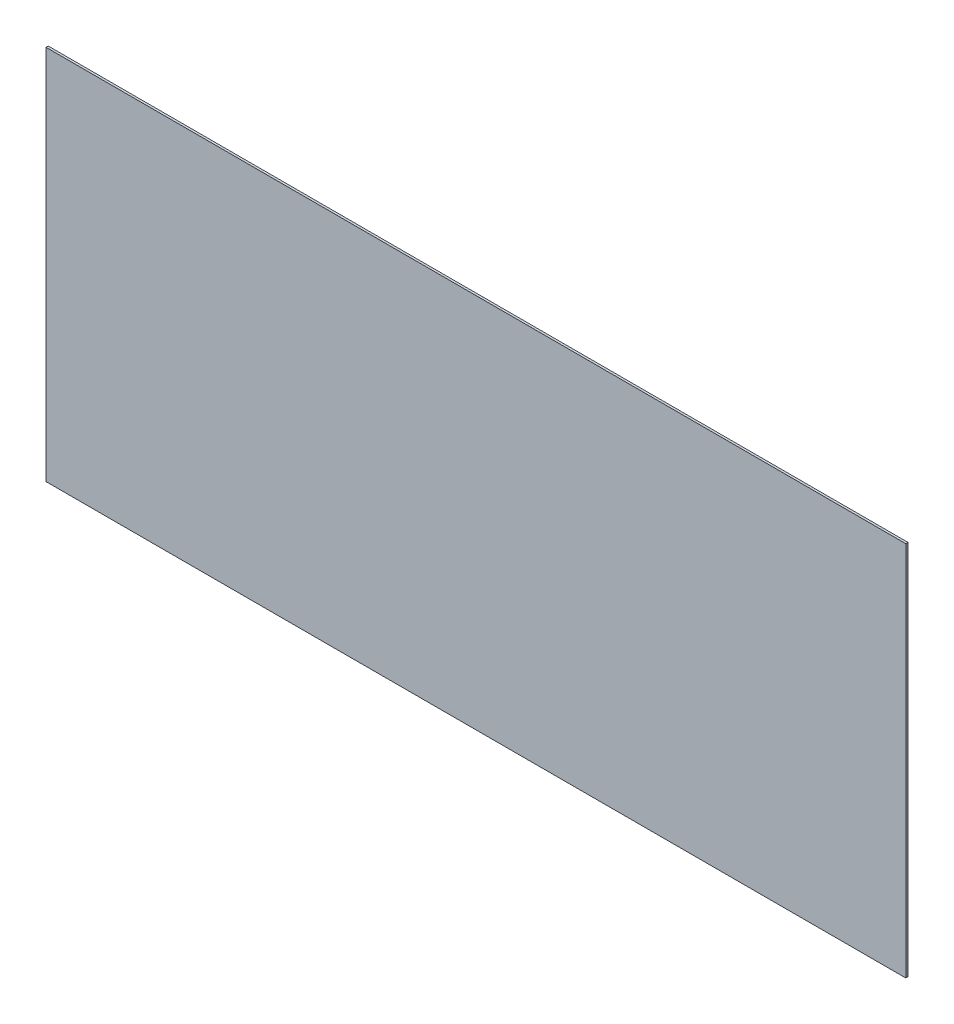
ISO-10303-21;
HEADER;
FILE_DESCRIPTION(('STEP AP214'),'2;1');
FILE_NAME('part.step','',(''),(''),'','','');
FILE_SCHEMA(('AUTOMOTIVE_DESIGN { 1 0 10303 214 1 1 1 1 }'));
ENDSEC;
DATA;
#1=APPLICATION_CONTEXT('core data for automotive mechanical design processes');
#2=APPLICATION_PROTOCOL_DEFINITION('international standard','automotive_design',2000,#1);
#3=PRODUCT_CONTEXT('',#1,'mechanical');
#4=PRODUCT('Part','Part','',(#3));
#5=PRODUCT_RELATED_PRODUCT_CATEGORY('part','',(#4));
#6=PRODUCT_DEFINITION_FORMATION('','',#4);
#7=PRODUCT_DEFINITION_CONTEXT('part definition',#1,'design');
#8=PRODUCT_DEFINITION('design','',#6,#7);
#9=PRODUCT_DEFINITION_SHAPE('','',#8);
#10=(LENGTH_UNIT() NAMED_UNIT(*) SI_UNIT(.MILLI.,.METRE.));
#11=(NAMED_UNIT(*) PLANE_ANGLE_UNIT() SI_UNIT($,.RADIAN.));
#12=(NAMED_UNIT(*) SI_UNIT($,.STERADIAN.) SOLID_ANGLE_UNIT());
#13=UNCERTAINTY_MEASURE_WITH_UNIT(LENGTH_MEASURE(1.E-05),#10,'distance_accuracy_value','');
#14=(GEOMETRIC_REPRESENTATION_CONTEXT(3) GLOBAL_UNCERTAINTY_ASSIGNED_CONTEXT((#13)) GLOBAL_UNIT_ASSIGNED_CONTEXT((#10,
#11,#12)) REPRESENTATION_CONTEXT('',''));
#15=CARTESIAN_POINT('',(0.,0.,0.));
#16=DIRECTION('',(0.,0.,1.));
#17=DIRECTION('',(1.,0.,0.));
#18=AXIS2_PLACEMENT_3D('',#15,#16,#17);
#19=CARTESIAN_POINT('',(0.,0.,3.175));
#20=DIRECTION('',(1.,0.,0.));
#21=DIRECTION('',(0.,0.,-1.));
#22=AXIS2_PLACEMENT_3D('',#19,#20,#21);
#23=PLANE('',#22);
#24=DIRECTION('',(0.,-1.,0.));
#25=VECTOR('',#24,1.);
#26=CARTESIAN_POINT('',(0.,0.,0.));
#27=LINE('',#26,#25);
#28=CARTESIAN_POINT('',(0.,533.4,0.));
#29=VERTEX_POINT('',#28);
#30=CARTESIAN_POINT('',(0.,0.,0.));
#31=VERTEX_POINT('',#30);
#32=EDGE_CURVE('E95',#29,#31,#27,.T.);
#33=ORIENTED_EDGE('',*,*,#32,.T.);
#34=DIRECTION('',(0.,0.,-1.));
#35=VECTOR('',#34,1.);
#36=CARTESIAN_POINT('',(0.,0.,3.175));
#37=LINE('',#36,#35);
#38=CARTESIAN_POINT('',(0.,0.,3.175));
#39=VERTEX_POINT('',#38);
#40=EDGE_CURVE('E11',#39,#31,#37,.T.);
#41=ORIENTED_EDGE('',*,*,#40,.F.);
#42=DIRECTION('',(0.,-1.,0.));
#43=VECTOR('',#42,1.);
#44=CARTESIAN_POINT('',(0.,0.,3.175));
#45=LINE('',#44,#43);
#46=CARTESIAN_POINT('',(0.,533.4,3.175));
#47=VERTEX_POINT('',#46);
#48=EDGE_CURVE('E83',#47,#39,#45,.T.);
#49=ORIENTED_EDGE('',*,*,#48,.F.);
#50=DIRECTION('',(0.,0.,-1.));
#51=VECTOR('',#50,1.);
#52=CARTESIAN_POINT('',(0.,533.4,3.175));
#53=LINE('',#52,#51);
#54=EDGE_CURVE('E91',#47,#29,#53,.T.);
#55=ORIENTED_EDGE('',*,*,#54,.T.);
#56=EDGE_LOOP('',(#33,#41,#49,#55));
#57=FACE_BOUND('',#56,.T.);
#58=ADVANCED_FACE('F32',(#57),#23,.F.);
#59=CARTESIAN_POINT('',(0.,0.,3.175));
#60=DIRECTION('',(0.,1.,0.));
#61=DIRECTION('',(0.,0.,1.));
#62=AXIS2_PLACEMENT_3D('',#59,#60,#61);
#63=PLANE('',#62);
#64=DIRECTION('',(1.,0.,0.));
#65=VECTOR('',#64,1.);
#66=CARTESIAN_POINT('',(0.,0.,0.));
#67=LINE('',#66,#65);
#68=CARTESIAN_POINT('',(1219.2,0.,0.));
#69=VERTEX_POINT('',#68);
#70=EDGE_CURVE('E87',#31,#69,#67,.T.);
#71=ORIENTED_EDGE('',*,*,#70,.T.);
#72=DIRECTION('',(0.,0.,-1.));
#73=VECTOR('',#72,1.);
#74=CARTESIAN_POINT('',(1219.2,0.,3.175));
#75=LINE('',#74,#73);
#76=CARTESIAN_POINT('',(1219.2,0.,3.175));
#77=VERTEX_POINT('',#76);
#78=EDGE_CURVE('E40',#77,#69,#75,.T.);
#79=ORIENTED_EDGE('',*,*,#78,.F.);
#80=DIRECTION('',(1.,0.,0.));
#81=VECTOR('',#80,1.);
#82=CARTESIAN_POINT('',(0.,0.,3.175));
#83=LINE('',#82,#81);
#84=EDGE_CURVE('E78',#39,#77,#83,.T.);
#85=ORIENTED_EDGE('',*,*,#84,.F.);
#86=ORIENTED_EDGE('',*,*,#40,.T.);
#87=EDGE_LOOP('',(#71,#79,#85,#86));
#88=FACE_BOUND('',#87,.T.);
#89=ADVANCED_FACE('F86',(#88),#63,.F.);
#90=CARTESIAN_POINT('',(1219.2,0.,3.175));
#91=DIRECTION('',(-1.,0.,0.));
#92=DIRECTION('',(0.,0.,1.));
#93=AXIS2_PLACEMENT_3D('',#90,#91,#92);
#94=PLANE('',#93);
#95=DIRECTION('',(0.,1.,0.));
#96=VECTOR('',#95,1.);
#97=CARTESIAN_POINT('',(1219.2,0.,0.));
#98=LINE('',#97,#96);
#99=CARTESIAN_POINT('',(1219.2,533.4,0.));
#100=VERTEX_POINT('',#99);
#101=EDGE_CURVE('E65',#69,#100,#98,.T.);
#102=ORIENTED_EDGE('',*,*,#101,.T.);
#103=DIRECTION('',(0.,0.,-1.));
#104=VECTOR('',#103,1.);
#105=CARTESIAN_POINT('',(1219.2,533.4,3.175));
#106=LINE('',#105,#104);
#107=CARTESIAN_POINT('',(1219.2,533.4,3.175));
#108=VERTEX_POINT('',#107);
#109=EDGE_CURVE('E88',#108,#100,#106,.T.);
#110=ORIENTED_EDGE('',*,*,#109,.F.);
#111=DIRECTION('',(0.,1.,0.));
#112=VECTOR('',#111,1.);
#113=CARTESIAN_POINT('',(1219.2,0.,3.175));
#114=LINE('',#113,#112);
#115=EDGE_CURVE('E81',#77,#108,#114,.T.);
#116=ORIENTED_EDGE('',*,*,#115,.F.);
#117=ORIENTED_EDGE('',*,*,#78,.T.);
#118=EDGE_LOOP('',(#102,#110,#116,#117));
#119=FACE_BOUND('',#118,.T.);
#120=ADVANCED_FACE('F89',(#119),#94,.F.);
#121=CARTESIAN_POINT('',(0.,533.4,3.175));
#122=DIRECTION('',(0.,-1.,0.));
#123=DIRECTION('',(0.,0.,-1.));
#124=AXIS2_PLACEMENT_3D('',#121,#122,#123);
#125=PLANE('',#124);
#126=DIRECTION('',(-1.,0.,0.));
#127=VECTOR('',#126,1.);
#128=CARTESIAN_POINT('',(0.,533.4,0.));
#129=LINE('',#128,#127);
#130=EDGE_CURVE('E71',#100,#29,#129,.T.);
#131=ORIENTED_EDGE('',*,*,#130,.T.);
#132=ORIENTED_EDGE('',*,*,#54,.F.);
#133=DIRECTION('',(-1.,0.,0.));
#134=VECTOR('',#133,1.);
#135=CARTESIAN_POINT('',(0.,533.4,3.175));
#136=LINE('',#135,#134);
#137=EDGE_CURVE('E48',#108,#47,#136,.T.);
#138=ORIENTED_EDGE('',*,*,#137,.F.);
#139=ORIENTED_EDGE('',*,*,#109,.T.);
#140=EDGE_LOOP('',(#131,#132,#138,#139));
#141=FACE_BOUND('',#140,.T.);
#142=ADVANCED_FACE('F102',(#141),#125,.F.);
#143=CARTESIAN_POINT('',(0.,0.,3.175));
#144=DIRECTION('',(0.,0.,-1.));
#145=DIRECTION('',(-1.,0.,0.));
#146=AXIS2_PLACEMENT_3D('',#143,#144,#145);
#147=PLANE('',#146);
#148=ORIENTED_EDGE('',*,*,#48,.T.);
#149=ORIENTED_EDGE('',*,*,#84,.T.);
#150=ORIENTED_EDGE('',*,*,#115,.T.);
#151=ORIENTED_EDGE('',*,*,#137,.T.);
#152=EDGE_LOOP('',(#148,#149,#150,#151));
#153=FACE_BOUND('',#152,.T.);
#154=ADVANCED_FACE('F79',(#153),#147,.F.);
#155=CARTESIAN_POINT('',(0.,0.,0.));
#156=DIRECTION('',(0.,0.,-1.));
#157=DIRECTION('',(-1.,0.,0.));
#158=AXIS2_PLACEMENT_3D('',#155,#156,#157);
#159=PLANE('',#158);
#160=ORIENTED_EDGE('',*,*,#32,.F.);
#161=ORIENTED_EDGE('',*,*,#130,.F.);
#162=ORIENTED_EDGE('',*,*,#101,.F.);
#163=ORIENTED_EDGE('',*,*,#70,.F.);
#164=EDGE_LOOP('',(#160,#161,#162,#163));
#165=FACE_BOUND('',#164,.T.);
#166=ADVANCED_FACE('F105',(#165),#159,.T.);
#167=CLOSED_SHELL('',(#58,#89,#120,#142,#154,#166));
#168=MANIFOLD_SOLID_BREP('B2',#167);
#169=ADVANCED_BREP_SHAPE_REPRESENTATION('',(#18,#168),#14);
#170=SHAPE_DEFINITION_REPRESENTATION(#9,#169);
ENDSEC;
END-ISO-10303-21;
